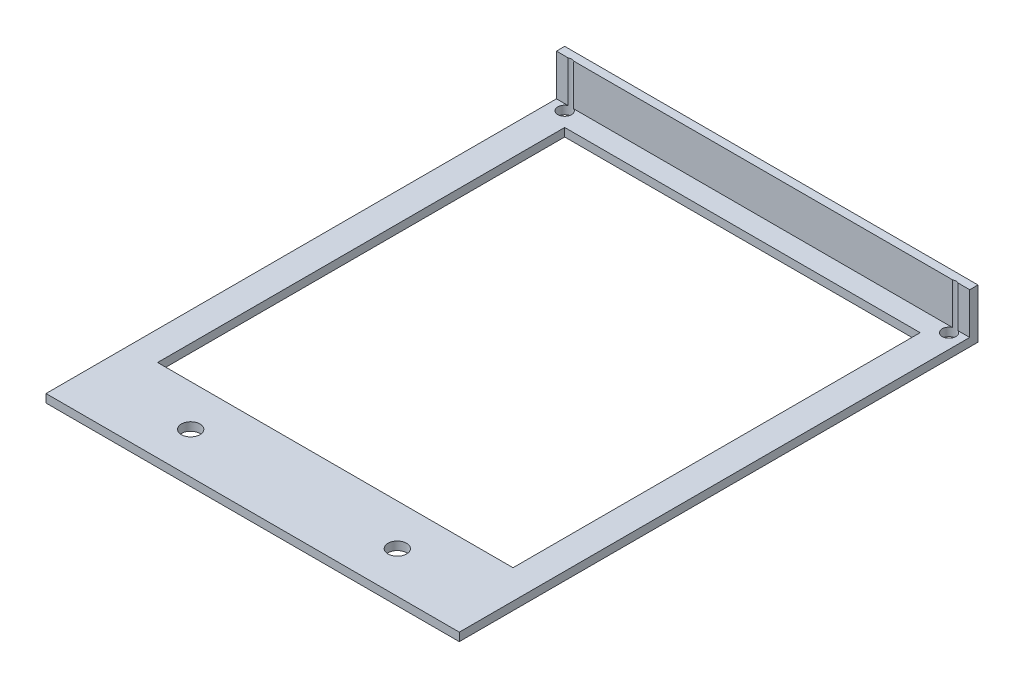
ISO-10303-21;
HEADER;
FILE_DESCRIPTION(('STEP AP214'),'2;1');
FILE_NAME('part.step','',(''),(''),'','','');
FILE_SCHEMA(('AUTOMOTIVE_DESIGN { 1 0 10303 214 1 1 1 1 }'));
ENDSEC;
DATA;
#1=APPLICATION_CONTEXT('core data for automotive mechanical design processes');
#2=APPLICATION_PROTOCOL_DEFINITION('international standard','automotive_design',2000,#1);
#3=PRODUCT_CONTEXT('',#1,'mechanical');
#4=PRODUCT('Part','Part','',(#3));
#5=PRODUCT_RELATED_PRODUCT_CATEGORY('part','',(#4));
#6=PRODUCT_DEFINITION_FORMATION('','',#4);
#7=PRODUCT_DEFINITION_CONTEXT('part definition',#1,'design');
#8=PRODUCT_DEFINITION('design','',#6,#7);
#9=PRODUCT_DEFINITION_SHAPE('','',#8);
#10=(LENGTH_UNIT() NAMED_UNIT(*) SI_UNIT(.MILLI.,.METRE.));
#11=(NAMED_UNIT(*) PLANE_ANGLE_UNIT() SI_UNIT($,.RADIAN.));
#12=(NAMED_UNIT(*) SI_UNIT($,.STERADIAN.) SOLID_ANGLE_UNIT());
#13=UNCERTAINTY_MEASURE_WITH_UNIT(LENGTH_MEASURE(1.E-05),#10,'distance_accuracy_value','');
#14=(GEOMETRIC_REPRESENTATION_CONTEXT(3) GLOBAL_UNCERTAINTY_ASSIGNED_CONTEXT((#13)) GLOBAL_UNIT_ASSIGNED_CONTEXT((#10,
#11,#12)) REPRESENTATION_CONTEXT('',''));
#15=CARTESIAN_POINT('',(0.,0.,0.));
#16=DIRECTION('',(0.,0.,1.));
#17=DIRECTION('',(1.,0.,0.));
#18=AXIS2_PLACEMENT_3D('',#15,#16,#17);
#19=CARTESIAN_POINT('',(-50.,12.,-60.75));
#20=DIRECTION('',(0.,0.,-1.));
#21=DIRECTION('',(-1.,0.,0.));
#22=AXIS2_PLACEMENT_3D('',#19,#20,#21);
#23=PLANE('',#22);
#24=DIRECTION('',(0.,-1.,0.));
#25=VECTOR('',#24,1.);
#26=CARTESIAN_POINT('',(-47.1873863542434,12.001,-60.75));
#27=LINE('',#26,#25);
#28=CARTESIAN_POINT('',(-47.1873863542434,12.,-60.75));
#29=VERTEX_POINT('',#28);
#30=CARTESIAN_POINT('',(-47.1873863542434,2.,-60.75));
#31=VERTEX_POINT('',#30);
#32=EDGE_CURVE('E252',#29,#31,#27,.T.);
#33=ORIENTED_EDGE('',*,*,#32,.F.);
#34=DIRECTION('',(1.,0.,0.));
#35=VECTOR('',#34,1.);
#36=CARTESIAN_POINT('',(-50.,12.,-60.75));
#37=LINE('',#36,#35);
#38=CARTESIAN_POINT('',(-50.,12.,-60.75));
#39=VERTEX_POINT('',#38);
#40=EDGE_CURVE('E156',#39,#29,#37,.T.);
#41=ORIENTED_EDGE('',*,*,#40,.F.);
#42=DIRECTION('',(0.,-1.,0.));
#43=VECTOR('',#42,1.);
#44=CARTESIAN_POINT('',(-50.,12.,-60.75));
#45=LINE('',#44,#43);
#46=CARTESIAN_POINT('',(-50.,2.,-60.75));
#47=VERTEX_POINT('',#46);
#48=EDGE_CURVE('E176',#39,#47,#45,.T.);
#49=ORIENTED_EDGE('',*,*,#48,.T.);
#50=DIRECTION('',(1.,0.,0.));
#51=VECTOR('',#50,1.);
#52=CARTESIAN_POINT('',(-50.,2.,-60.75));
#53=LINE('',#52,#51);
#54=EDGE_CURVE('E170',#47,#31,#53,.T.);
#55=ORIENTED_EDGE('',*,*,#54,.T.);
#56=EDGE_LOOP('',(#33,#41,#49,#55));
#57=FACE_BOUND('',#56,.T.);
#58=ADVANCED_FACE('F35',(#57),#23,.F.);
#59=DIRECTION('',(0.,-1.,0.));
#60=VECTOR('',#59,1.);
#61=CARTESIAN_POINT('',(-45.8126136457566,12.001,-60.75));
#62=LINE('',#61,#60);
#63=CARTESIAN_POINT('',(-45.8126136457566,2.,-60.75));
#64=VERTEX_POINT('',#63);
#65=CARTESIAN_POINT('',(-45.8126136457566,12.,-60.75));
#66=VERTEX_POINT('',#65);
#67=EDGE_CURVE('E60',#64,#66,#62,.F.);
#68=ORIENTED_EDGE('',*,*,#67,.F.);
#69=CARTESIAN_POINT('',(45.8126136457566,2.,-60.75));
#70=VERTEX_POINT('',#69);
#71=EDGE_CURVE('E151',#64,#70,#53,.T.);
#72=ORIENTED_EDGE('',*,*,#71,.T.);
#73=DIRECTION('',(0.,-1.,0.));
#74=VECTOR('',#73,1.);
#75=CARTESIAN_POINT('',(45.8126136457566,12.001,-60.75));
#76=LINE('',#75,#74);
#77=CARTESIAN_POINT('',(45.8126136457566,12.,-60.75));
#78=VERTEX_POINT('',#77);
#79=EDGE_CURVE('E138',#78,#70,#76,.T.);
#80=ORIENTED_EDGE('',*,*,#79,.F.);
#81=EDGE_CURVE('E149',#66,#78,#37,.T.);
#82=ORIENTED_EDGE('',*,*,#81,.F.);
#83=EDGE_LOOP('',(#68,#72,#80,#82));
#84=FACE_BOUND('',#83,.T.);
#85=ADVANCED_FACE('F148',(#84),#23,.F.);
#86=DIRECTION('',(0.,-1.,0.));
#87=VECTOR('',#86,1.);
#88=CARTESIAN_POINT('',(47.1873863542434,12.001,-60.75));
#89=LINE('',#88,#87);
#90=CARTESIAN_POINT('',(47.1873863542434,2.,-60.75));
#91=VERTEX_POINT('',#90);
#92=CARTESIAN_POINT('',(47.1873863542434,12.,-60.75));
#93=VERTEX_POINT('',#92);
#94=EDGE_CURVE('E52',#91,#93,#89,.F.);
#95=ORIENTED_EDGE('',*,*,#94,.F.);
#96=CARTESIAN_POINT('',(50.,2.,-60.75));
#97=VERTEX_POINT('',#96);
#98=EDGE_CURVE('E173',#91,#97,#53,.T.);
#99=ORIENTED_EDGE('',*,*,#98,.T.);
#100=DIRECTION('',(0.,-1.,0.));
#101=VECTOR('',#100,1.);
#102=CARTESIAN_POINT('',(50.,12.,-60.75));
#103=LINE('',#102,#101);
#104=CARTESIAN_POINT('',(50.,12.,-60.75));
#105=VERTEX_POINT('',#104);
#106=EDGE_CURVE('E169',#105,#97,#103,.T.);
#107=ORIENTED_EDGE('',*,*,#106,.F.);
#108=EDGE_CURVE('E157',#93,#105,#37,.T.);
#109=ORIENTED_EDGE('',*,*,#108,.F.);
#110=EDGE_LOOP('',(#95,#99,#107,#109));
#111=FACE_BOUND('',#110,.T.);
#112=ADVANCED_FACE('F300',(#111),#23,.F.);
#113=CARTESIAN_POINT('',(0.,12.,0.));
#114=DIRECTION('',(0.,1.,0.));
#115=DIRECTION('',(0.,0.,1.));
#116=AXIS2_PLACEMENT_3D('',#113,#114,#115);
#117=PLANE('',#116);
#118=ORIENTED_EDGE('',*,*,#40,.T.);
#119=CARTESIAN_POINT('',(-46.5,12.,-59.25));
#120=DIRECTION('',(0.,1.,0.));
#121=DIRECTION('',(0.,0.,1.));
#122=AXIS2_PLACEMENT_3D('',#119,#120,#121);
#123=CIRCLE('',#122,1.65);
#124=EDGE_CURVE('E155',#29,#66,#123,.F.);
#125=ORIENTED_EDGE('',*,*,#124,.T.);
#126=ORIENTED_EDGE('',*,*,#81,.T.);
#127=CARTESIAN_POINT('',(46.5,12.,-59.25));
#128=DIRECTION('',(0.,1.,0.));
#129=DIRECTION('',(0.,0.,1.));
#130=AXIS2_PLACEMENT_3D('',#127,#128,#129);
#131=CIRCLE('',#130,1.65);
#132=EDGE_CURVE('E135',#78,#93,#131,.F.);
#133=ORIENTED_EDGE('',*,*,#132,.T.);
#134=ORIENTED_EDGE('',*,*,#108,.T.);
#135=DIRECTION('',(0.,0.,-1.));
#136=VECTOR('',#135,1.);
#137=CARTESIAN_POINT('',(50.,12.,-62.75));
#138=LINE('',#137,#136);
#139=CARTESIAN_POINT('',(50.,12.,-62.75));
#140=VERTEX_POINT('',#139);
#141=EDGE_CURVE('E159',#105,#140,#138,.T.);
#142=ORIENTED_EDGE('',*,*,#141,.T.);
#143=DIRECTION('',(-1.,0.,0.));
#144=VECTOR('',#143,1.);
#145=CARTESIAN_POINT('',(-50.,12.,-62.75));
#146=LINE('',#145,#144);
#147=CARTESIAN_POINT('',(-50.,12.,-62.75));
#148=VERTEX_POINT('',#147);
#149=EDGE_CURVE('E166',#140,#148,#146,.T.);
#150=ORIENTED_EDGE('',*,*,#149,.T.);
#151=DIRECTION('',(0.,0.,1.));
#152=VECTOR('',#151,1.);
#153=CARTESIAN_POINT('',(-50.,12.,-62.75));
#154=LINE('',#153,#152);
#155=EDGE_CURVE('E160',#148,#39,#154,.T.);
#156=ORIENTED_EDGE('',*,*,#155,.T.);
#157=EDGE_LOOP('',(#118,#125,#126,#133,#134,#142,#150,#156));
#158=FACE_BOUND('',#157,.T.);
#159=ADVANCED_FACE('F154',(#158),#117,.T.);
#160=CARTESIAN_POINT('',(0.,2.,0.));
#161=DIRECTION('',(0.,-1.,0.));
#162=DIRECTION('',(0.,0.,-1.));
#163=AXIS2_PLACEMENT_3D('',#160,#161,#162);
#164=PLANE('',#163);
#165=CARTESIAN_POINT('',(-46.5,2.,-59.25));
#166=DIRECTION('',(0.,-1.,0.));
#167=DIRECTION('',(0.,0.,-1.));
#168=AXIS2_PLACEMENT_3D('',#165,#166,#167);
#169=CIRCLE('',#168,1.65);
#170=EDGE_CURVE('E143',#31,#64,#169,.F.);
#171=ORIENTED_EDGE('',*,*,#170,.F.);
#172=ORIENTED_EDGE('',*,*,#54,.F.);
#173=DIRECTION('',(0.,0.,1.));
#174=VECTOR('',#173,1.);
#175=CARTESIAN_POINT('',(-50.,2.,62.75));
#176=LINE('',#175,#174);
#177=CARTESIAN_POINT('',(-50.,2.,62.75));
#178=VERTEX_POINT('',#177);
#179=EDGE_CURVE('E183',#47,#178,#176,.T.);
#180=ORIENTED_EDGE('',*,*,#179,.T.);
#181=DIRECTION('',(1.,0.,0.));
#182=VECTOR('',#181,1.);
#183=CARTESIAN_POINT('',(-50.,2.,62.75));
#184=LINE('',#183,#182);
#185=CARTESIAN_POINT('',(50.,2.,62.75));
#186=VERTEX_POINT('',#185);
#187=EDGE_CURVE('E186',#178,#186,#184,.T.);
#188=ORIENTED_EDGE('',*,*,#187,.T.);
#189=DIRECTION('',(0.,0.,-1.));
#190=VECTOR('',#189,1.);
#191=CARTESIAN_POINT('',(50.,2.,62.75));
#192=LINE('',#191,#190);
#193=EDGE_CURVE('E180',#186,#97,#192,.T.);
#194=ORIENTED_EDGE('',*,*,#193,.T.);
#195=ORIENTED_EDGE('',*,*,#98,.F.);
#196=CARTESIAN_POINT('',(46.5,2.,-59.25));
#197=DIRECTION('',(0.,-1.,0.));
#198=DIRECTION('',(0.,0.,-1.));
#199=AXIS2_PLACEMENT_3D('',#196,#197,#198);
#200=CIRCLE('',#199,1.65);
#201=EDGE_CURVE('E255',#70,#91,#200,.F.);
#202=ORIENTED_EDGE('',*,*,#201,.F.);
#203=ORIENTED_EDGE('',*,*,#71,.F.);
#204=EDGE_LOOP('',(#171,#172,#180,#188,#194,#195,#202,#203));
#205=FACE_BOUND('',#204,.T.);
#206=CARTESIAN_POINT('',(-25.,2.,52.75));
#207=DIRECTION('',(0.,-1.,0.));
#208=DIRECTION('',(0.,0.,-1.));
#209=AXIS2_PLACEMENT_3D('',#206,#207,#208);
#210=CIRCLE('',#209,2.25);
#211=CARTESIAN_POINT('',(-25.,2.,50.5));
#212=VERTEX_POINT('',#211);
#213=EDGE_CURVE('E249',#212,#212,#210,.F.);
#214=ORIENTED_EDGE('',*,*,#213,.F.);
#215=EDGE_LOOP('',(#214));
#216=FACE_BOUND('',#215,.T.);
#217=CARTESIAN_POINT('',(25.,2.,52.75));
#218=DIRECTION('',(0.,-1.,0.));
#219=DIRECTION('',(0.,0.,-1.));
#220=AXIS2_PLACEMENT_3D('',#217,#218,#219);
#221=CIRCLE('',#220,2.25);
#222=CARTESIAN_POINT('',(25.,2.,50.5));
#223=VERTEX_POINT('',#222);
#224=EDGE_CURVE('E244',#223,#223,#221,.F.);
#225=ORIENTED_EDGE('',*,*,#224,.F.);
#226=EDGE_LOOP('',(#225));
#227=FACE_BOUND('',#226,.T.);
#228=DIRECTION('',(0.,0.,1.));
#229=VECTOR('',#228,1.);
#230=CARTESIAN_POINT('',(-43.,2.,-55.75));
#231=LINE('',#230,#229);
#232=CARTESIAN_POINT('',(-43.,2.,-55.75));
#233=VERTEX_POINT('',#232);
#234=CARTESIAN_POINT('',(-43.,2.,42.75));
#235=VERTEX_POINT('',#234);
#236=EDGE_CURVE('E208',#233,#235,#231,.T.);
#237=ORIENTED_EDGE('',*,*,#236,.F.);
#238=DIRECTION('',(-1.,0.,0.));
#239=VECTOR('',#238,1.);
#240=CARTESIAN_POINT('',(-43.,2.,-55.75));
#241=LINE('',#240,#239);
#242=CARTESIAN_POINT('',(43.,2.,-55.75));
#243=VERTEX_POINT('',#242);
#244=EDGE_CURVE('E216',#243,#233,#241,.T.);
#245=ORIENTED_EDGE('',*,*,#244,.F.);
#246=DIRECTION('',(0.,0.,-1.));
#247=VECTOR('',#246,1.);
#248=CARTESIAN_POINT('',(43.,2.,-55.75));
#249=LINE('',#248,#247);
#250=CARTESIAN_POINT('',(43.,2.,42.75));
#251=VERTEX_POINT('',#250);
#252=EDGE_CURVE('E213',#251,#243,#249,.T.);
#253=ORIENTED_EDGE('',*,*,#252,.F.);
#254=DIRECTION('',(1.,0.,0.));
#255=VECTOR('',#254,1.);
#256=CARTESIAN_POINT('',(-43.,2.,42.75));
#257=LINE('',#256,#255);
#258=EDGE_CURVE('E210',#235,#251,#257,.T.);
#259=ORIENTED_EDGE('',*,*,#258,.F.);
#260=EDGE_LOOP('',(#237,#245,#253,#259));
#261=FACE_BOUND('',#260,.T.);
#262=ADVANCED_FACE('F263',(#205,#216,#227,#261),#164,.F.);
#263=CARTESIAN_POINT('',(0.,0.,0.));
#264=DIRECTION('',(0.,-1.,0.));
#265=DIRECTION('',(0.,0.,-1.));
#266=AXIS2_PLACEMENT_3D('',#263,#264,#265);
#267=PLANE('',#266);
#268=CARTESIAN_POINT('',(-46.5,0.,-59.25));
#269=DIRECTION('',(0.,-1.,0.));
#270=DIRECTION('',(0.,0.,-1.));
#271=AXIS2_PLACEMENT_3D('',#268,#269,#270);
#272=CIRCLE('',#271,1.65);
#273=CARTESIAN_POINT('',(-46.5,0.,-60.9));
#274=VERTEX_POINT('',#273);
#275=EDGE_CURVE('E235',#274,#274,#272,.F.);
#276=ORIENTED_EDGE('',*,*,#275,.T.);
#277=EDGE_LOOP('',(#276));
#278=FACE_BOUND('',#277,.T.);
#279=CARTESIAN_POINT('',(46.5,0.,-59.25));
#280=DIRECTION('',(0.,-1.,0.));
#281=DIRECTION('',(0.,0.,-1.));
#282=AXIS2_PLACEMENT_3D('',#279,#280,#281);
#283=CIRCLE('',#282,1.65);
#284=CARTESIAN_POINT('',(46.5,0.,-60.9));
#285=VERTEX_POINT('',#284);
#286=EDGE_CURVE('E240',#285,#285,#283,.F.);
#287=ORIENTED_EDGE('',*,*,#286,.T.);
#288=EDGE_LOOP('',(#287));
#289=FACE_BOUND('',#288,.T.);
#290=CARTESIAN_POINT('',(-25.,0.,52.75));
#291=DIRECTION('',(0.,-1.,0.));
#292=DIRECTION('',(0.,0.,-1.));
#293=AXIS2_PLACEMENT_3D('',#290,#291,#292);
#294=CIRCLE('',#293,2.25);
#295=CARTESIAN_POINT('',(-25.,0.,50.5));
#296=VERTEX_POINT('',#295);
#297=EDGE_CURVE('E39',#296,#296,#294,.F.);
#298=ORIENTED_EDGE('',*,*,#297,.T.);
#299=EDGE_LOOP('',(#298));
#300=FACE_BOUND('',#299,.T.);
#301=CARTESIAN_POINT('',(25.,0.,52.75));
#302=DIRECTION('',(0.,-1.,0.));
#303=DIRECTION('',(0.,0.,-1.));
#304=AXIS2_PLACEMENT_3D('',#301,#302,#303);
#305=CIRCLE('',#304,2.25);
#306=CARTESIAN_POINT('',(25.,0.,50.5));
#307=VERTEX_POINT('',#306);
#308=EDGE_CURVE('E233',#307,#307,#305,.F.);
#309=ORIENTED_EDGE('',*,*,#308,.T.);
#310=EDGE_LOOP('',(#309));
#311=FACE_BOUND('',#310,.T.);
#312=DIRECTION('',(-1.,0.,0.));
#313=VECTOR('',#312,1.);
#314=CARTESIAN_POINT('',(-43.,0.,-55.75));
#315=LINE('',#314,#313);
#316=CARTESIAN_POINT('',(43.,0.,-55.75));
#317=VERTEX_POINT('',#316);
#318=CARTESIAN_POINT('',(-43.,0.,-55.75));
#319=VERTEX_POINT('',#318);
#320=EDGE_CURVE('E211',#317,#319,#315,.T.);
#321=ORIENTED_EDGE('',*,*,#320,.T.);
#322=DIRECTION('',(0.,0.,1.));
#323=VECTOR('',#322,1.);
#324=CARTESIAN_POINT('',(-43.,0.,-55.75));
#325=LINE('',#324,#323);
#326=CARTESIAN_POINT('',(-43.,0.,42.75));
#327=VERTEX_POINT('',#326);
#328=EDGE_CURVE('E207',#319,#327,#325,.T.);
#329=ORIENTED_EDGE('',*,*,#328,.T.);
#330=DIRECTION('',(1.,0.,0.));
#331=VECTOR('',#330,1.);
#332=CARTESIAN_POINT('',(-43.,0.,42.75));
#333=LINE('',#332,#331);
#334=CARTESIAN_POINT('',(43.,0.,42.75));
#335=VERTEX_POINT('',#334);
#336=EDGE_CURVE('E221',#327,#335,#333,.T.);
#337=ORIENTED_EDGE('',*,*,#336,.T.);
#338=DIRECTION('',(0.,0.,-1.));
#339=VECTOR('',#338,1.);
#340=CARTESIAN_POINT('',(43.,0.,-55.75));
#341=LINE('',#340,#339);
#342=EDGE_CURVE('E224',#335,#317,#341,.T.);
#343=ORIENTED_EDGE('',*,*,#342,.T.);
#344=EDGE_LOOP('',(#321,#329,#337,#343));
#345=FACE_BOUND('',#344,.T.);
#346=DIRECTION('',(0.,0.,-1.));
#347=VECTOR('',#346,1.);
#348=CARTESIAN_POINT('',(50.,0.,62.75));
#349=LINE('',#348,#347);
#350=CARTESIAN_POINT('',(50.,0.,62.75));
#351=VERTEX_POINT('',#350);
#352=CARTESIAN_POINT('',(50.,0.,-62.75));
#353=VERTEX_POINT('',#352);
#354=EDGE_CURVE('E179',#351,#353,#349,.T.);
#355=ORIENTED_EDGE('',*,*,#354,.F.);
#356=DIRECTION('',(1.,0.,0.));
#357=VECTOR('',#356,1.);
#358=CARTESIAN_POINT('',(-50.,0.,62.75));
#359=LINE('',#358,#357);
#360=CARTESIAN_POINT('',(-50.,0.,62.75));
#361=VERTEX_POINT('',#360);
#362=EDGE_CURVE('E184',#361,#351,#359,.T.);
#363=ORIENTED_EDGE('',*,*,#362,.F.);
#364=DIRECTION('',(0.,0.,1.));
#365=VECTOR('',#364,1.);
#366=CARTESIAN_POINT('',(-50.,0.,62.75));
#367=LINE('',#366,#365);
#368=CARTESIAN_POINT('',(-50.,0.,-62.75));
#369=VERTEX_POINT('',#368);
#370=EDGE_CURVE('E193',#369,#361,#367,.T.);
#371=ORIENTED_EDGE('',*,*,#370,.F.);
#372=DIRECTION('',(-1.,0.,0.));
#373=VECTOR('',#372,1.);
#374=CARTESIAN_POINT('',(-50.,0.,-62.75));
#375=LINE('',#374,#373);
#376=EDGE_CURVE('E191',#353,#369,#375,.T.);
#377=ORIENTED_EDGE('',*,*,#376,.F.);
#378=EDGE_LOOP('',(#355,#363,#371,#377));
#379=FACE_BOUND('',#378,.T.);
#380=ADVANCED_FACE('F37',(#278,#289,#300,#311,#345,#379),#267,.T.);
#381=CARTESIAN_POINT('',(-43.,2.,-55.75));
#382=DIRECTION('',(1.,0.,0.));
#383=DIRECTION('',(0.,0.,-1.));
#384=AXIS2_PLACEMENT_3D('',#381,#382,#383);
#385=PLANE('',#384);
#386=ORIENTED_EDGE('',*,*,#328,.F.);
#387=DIRECTION('',(0.,-1.,0.));
#388=VECTOR('',#387,1.);
#389=CARTESIAN_POINT('',(-43.,2.,-55.75));
#390=LINE('',#389,#388);
#391=EDGE_CURVE('E218',#233,#319,#390,.T.);
#392=ORIENTED_EDGE('',*,*,#391,.F.);
#393=ORIENTED_EDGE('',*,*,#236,.T.);
#394=DIRECTION('',(0.,-1.,0.));
#395=VECTOR('',#394,1.);
#396=CARTESIAN_POINT('',(-43.,2.,42.75));
#397=LINE('',#396,#395);
#398=EDGE_CURVE('E11',#235,#327,#397,.T.);
#399=ORIENTED_EDGE('',*,*,#398,.T.);
#400=EDGE_LOOP('',(#386,#392,#393,#399));
#401=FACE_BOUND('',#400,.T.);
#402=ADVANCED_FACE('F276',(#401),#385,.T.);
#403=CARTESIAN_POINT('',(-43.,2.,42.75));
#404=DIRECTION('',(0.,0.,-1.));
#405=DIRECTION('',(-1.,0.,0.));
#406=AXIS2_PLACEMENT_3D('',#403,#404,#405);
#407=PLANE('',#406);
#408=ORIENTED_EDGE('',*,*,#336,.F.);
#409=ORIENTED_EDGE('',*,*,#398,.F.);
#410=ORIENTED_EDGE('',*,*,#258,.T.);
#411=DIRECTION('',(0.,-1.,0.));
#412=VECTOR('',#411,1.);
#413=CARTESIAN_POINT('',(43.,2.,42.75));
#414=LINE('',#413,#412);
#415=EDGE_CURVE('E44',#251,#335,#414,.T.);
#416=ORIENTED_EDGE('',*,*,#415,.T.);
#417=EDGE_LOOP('',(#408,#409,#410,#416));
#418=FACE_BOUND('',#417,.T.);
#419=ADVANCED_FACE('F278',(#418),#407,.T.);
#420=CARTESIAN_POINT('',(43.,2.,-55.75));
#421=DIRECTION('',(-1.,0.,0.));
#422=DIRECTION('',(0.,0.,1.));
#423=AXIS2_PLACEMENT_3D('',#420,#421,#422);
#424=PLANE('',#423);
#425=ORIENTED_EDGE('',*,*,#342,.F.);
#426=ORIENTED_EDGE('',*,*,#415,.F.);
#427=ORIENTED_EDGE('',*,*,#252,.T.);
#428=DIRECTION('',(0.,-1.,0.));
#429=VECTOR('',#428,1.);
#430=CARTESIAN_POINT('',(43.,2.,-55.75));
#431=LINE('',#430,#429);
#432=EDGE_CURVE('E231',#243,#317,#431,.T.);
#433=ORIENTED_EDGE('',*,*,#432,.T.);
#434=EDGE_LOOP('',(#425,#426,#427,#433));
#435=FACE_BOUND('',#434,.T.);
#436=ADVANCED_FACE('F287',(#435),#424,.T.);
#437=CARTESIAN_POINT('',(-43.,2.,-55.75));
#438=DIRECTION('',(0.,0.,1.));
#439=DIRECTION('',(1.,0.,0.));
#440=AXIS2_PLACEMENT_3D('',#437,#438,#439);
#441=PLANE('',#440);
#442=ORIENTED_EDGE('',*,*,#320,.F.);
#443=ORIENTED_EDGE('',*,*,#432,.F.);
#444=ORIENTED_EDGE('',*,*,#244,.T.);
#445=ORIENTED_EDGE('',*,*,#391,.T.);
#446=EDGE_LOOP('',(#442,#443,#444,#445));
#447=FACE_BOUND('',#446,.T.);
#448=ADVANCED_FACE('F285',(#447),#441,.T.);
#449=CARTESIAN_POINT('',(50.,2.,62.75));
#450=DIRECTION('',(-1.,0.,0.));
#451=DIRECTION('',(0.,0.,1.));
#452=AXIS2_PLACEMENT_3D('',#449,#450,#451);
#453=PLANE('',#452);
#454=ORIENTED_EDGE('',*,*,#354,.T.);
#455=DIRECTION('',(0.,-1.,0.));
#456=VECTOR('',#455,1.);
#457=CARTESIAN_POINT('',(50.,2.,-62.75));
#458=LINE('',#457,#456);
#459=EDGE_CURVE('E204',#140,#353,#458,.T.);
#460=ORIENTED_EDGE('',*,*,#459,.F.);
#461=ORIENTED_EDGE('',*,*,#141,.F.);
#462=ORIENTED_EDGE('',*,*,#106,.T.);
#463=ORIENTED_EDGE('',*,*,#193,.F.);
#464=DIRECTION('',(0.,-1.,0.));
#465=VECTOR('',#464,1.);
#466=CARTESIAN_POINT('',(50.,2.,62.75));
#467=LINE('',#466,#465);
#468=EDGE_CURVE('E188',#186,#351,#467,.T.);
#469=ORIENTED_EDGE('',*,*,#468,.T.);
#470=EDGE_LOOP('',(#454,#460,#461,#462,#463,#469));
#471=FACE_BOUND('',#470,.T.);
#472=ADVANCED_FACE('F294',(#471),#453,.F.);
#473=CARTESIAN_POINT('',(-50.,2.,-62.75));
#474=DIRECTION('',(0.,0.,1.));
#475=DIRECTION('',(1.,0.,0.));
#476=AXIS2_PLACEMENT_3D('',#473,#474,#475);
#477=PLANE('',#476);
#478=ORIENTED_EDGE('',*,*,#376,.T.);
#479=DIRECTION('',(0.,-1.,0.));
#480=VECTOR('',#479,1.);
#481=CARTESIAN_POINT('',(-50.,2.,-62.75));
#482=LINE('',#481,#480);
#483=EDGE_CURVE('E201',#148,#369,#482,.T.);
#484=ORIENTED_EDGE('',*,*,#483,.F.);
#485=ORIENTED_EDGE('',*,*,#149,.F.);
#486=ORIENTED_EDGE('',*,*,#459,.T.);
#487=EDGE_LOOP('',(#478,#484,#485,#486));
#488=FACE_BOUND('',#487,.T.);
#489=ADVANCED_FACE('F324',(#488),#477,.F.);
#490=CARTESIAN_POINT('',(-50.,2.,62.75));
#491=DIRECTION('',(1.,0.,0.));
#492=DIRECTION('',(0.,0.,-1.));
#493=AXIS2_PLACEMENT_3D('',#490,#491,#492);
#494=PLANE('',#493);
#495=ORIENTED_EDGE('',*,*,#370,.T.);
#496=DIRECTION('',(0.,-1.,0.));
#497=VECTOR('',#496,1.);
#498=CARTESIAN_POINT('',(-50.,2.,62.75));
#499=LINE('',#498,#497);
#500=EDGE_CURVE('E198',#178,#361,#499,.T.);
#501=ORIENTED_EDGE('',*,*,#500,.F.);
#502=ORIENTED_EDGE('',*,*,#179,.F.);
#503=ORIENTED_EDGE('',*,*,#48,.F.);
#504=ORIENTED_EDGE('',*,*,#155,.F.);
#505=ORIENTED_EDGE('',*,*,#483,.T.);
#506=EDGE_LOOP('',(#495,#501,#502,#503,#504,#505));
#507=FACE_BOUND('',#506,.T.);
#508=ADVANCED_FACE('F327',(#507),#494,.F.);
#509=CARTESIAN_POINT('',(-50.,2.,62.75));
#510=DIRECTION('',(0.,0.,-1.));
#511=DIRECTION('',(-1.,0.,0.));
#512=AXIS2_PLACEMENT_3D('',#509,#510,#511);
#513=PLANE('',#512);
#514=ORIENTED_EDGE('',*,*,#362,.T.);
#515=ORIENTED_EDGE('',*,*,#468,.F.);
#516=ORIENTED_EDGE('',*,*,#187,.F.);
#517=ORIENTED_EDGE('',*,*,#500,.T.);
#518=EDGE_LOOP('',(#514,#515,#516,#517));
#519=FACE_BOUND('',#518,.T.);
#520=ADVANCED_FACE('F333',(#519),#513,.F.);
#521=CARTESIAN_POINT('',(46.5,-1.2E-05,-59.25));
#522=DIRECTION('',(0.,1.,0.));
#523=DIRECTION('',(0.,0.,1.));
#524=AXIS2_PLACEMENT_3D('',#521,#522,#523);
#525=CYLINDRICAL_SURFACE('',#524,1.65);
#526=ORIENTED_EDGE('',*,*,#286,.F.);
#527=EDGE_LOOP('',(#526));
#528=FACE_BOUND('',#527,.T.);
#529=ORIENTED_EDGE('',*,*,#201,.T.);
#530=ORIENTED_EDGE('',*,*,#94,.T.);
#531=ORIENTED_EDGE('',*,*,#132,.F.);
#532=ORIENTED_EDGE('',*,*,#79,.T.);
#533=EDGE_LOOP('',(#529,#530,#531,#532));
#534=FACE_BOUND('',#533,.T.);
#535=ADVANCED_FACE('F137',(#528,#534),#525,.F.);
#536=CARTESIAN_POINT('',(-46.5,-1.2E-05,-59.25));
#537=DIRECTION('',(0.,1.,0.));
#538=DIRECTION('',(0.,0.,1.));
#539=AXIS2_PLACEMENT_3D('',#536,#537,#538);
#540=CYLINDRICAL_SURFACE('',#539,1.65);
#541=ORIENTED_EDGE('',*,*,#275,.F.);
#542=EDGE_LOOP('',(#541));
#543=FACE_BOUND('',#542,.T.);
#544=ORIENTED_EDGE('',*,*,#170,.T.);
#545=ORIENTED_EDGE('',*,*,#67,.T.);
#546=ORIENTED_EDGE('',*,*,#124,.F.);
#547=ORIENTED_EDGE('',*,*,#32,.T.);
#548=EDGE_LOOP('',(#544,#545,#546,#547));
#549=FACE_BOUND('',#548,.T.);
#550=ADVANCED_FACE('F335',(#543,#549),#540,.F.);
#551=CARTESIAN_POINT('',(25.,-1.2E-05,52.75));
#552=DIRECTION('',(0.,1.,0.));
#553=DIRECTION('',(0.,0.,1.));
#554=AXIS2_PLACEMENT_3D('',#551,#552,#553);
#555=CYLINDRICAL_SURFACE('',#554,2.25);
#556=ORIENTED_EDGE('',*,*,#308,.F.);
#557=EDGE_LOOP('',(#556));
#558=FACE_BOUND('',#557,.T.);
#559=ORIENTED_EDGE('',*,*,#224,.T.);
#560=EDGE_LOOP('',(#559));
#561=FACE_BOUND('',#560,.T.);
#562=ADVANCED_FACE('F337',(#558,#561),#555,.F.);
#563=CARTESIAN_POINT('',(-25.,-1.2E-05,52.75));
#564=DIRECTION('',(0.,1.,0.));
#565=DIRECTION('',(0.,0.,1.));
#566=AXIS2_PLACEMENT_3D('',#563,#564,#565);
#567=CYLINDRICAL_SURFACE('',#566,2.25);
#568=ORIENTED_EDGE('',*,*,#297,.F.);
#569=EDGE_LOOP('',(#568));
#570=FACE_BOUND('',#569,.T.);
#571=ORIENTED_EDGE('',*,*,#213,.T.);
#572=EDGE_LOOP('',(#571));
#573=FACE_BOUND('',#572,.T.);
#574=ADVANCED_FACE('F261',(#570,#573),#567,.F.);
#575=CLOSED_SHELL('',(#58,#85,#112,#159,#262,#380,#402,#419,#436,#448,#472,#489,#508,#520,#535,
#550,#562,#574));
#576=MANIFOLD_SOLID_BREP('B2',#575);
#577=ADVANCED_BREP_SHAPE_REPRESENTATION('',(#18,#576),#14);
#578=SHAPE_DEFINITION_REPRESENTATION(#9,#577);
ENDSEC;
END-ISO-10303-21;
